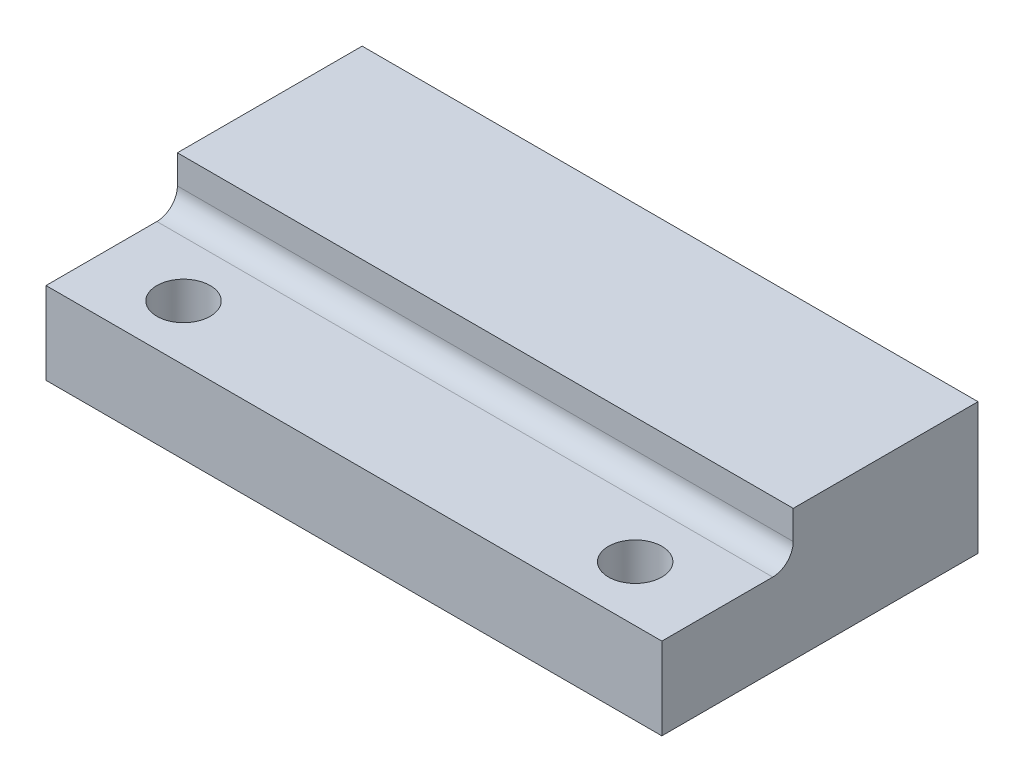
ISO-10303-21;
HEADER;
FILE_DESCRIPTION(('STEP AP214'),'2;1');
FILE_NAME('part.step','',(''),(''),'','','');
FILE_SCHEMA(('AUTOMOTIVE_DESIGN { 1 0 10303 214 1 1 1 1 }'));
ENDSEC;
DATA;
#1=APPLICATION_CONTEXT('core data for automotive mechanical design processes');
#2=APPLICATION_PROTOCOL_DEFINITION('international standard','automotive_design',2000,#1);
#3=PRODUCT_CONTEXT('',#1,'mechanical');
#4=PRODUCT('Part','Part','',(#3));
#5=PRODUCT_RELATED_PRODUCT_CATEGORY('part','',(#4));
#6=PRODUCT_DEFINITION_FORMATION('','',#4);
#7=PRODUCT_DEFINITION_CONTEXT('part definition',#1,'design');
#8=PRODUCT_DEFINITION('design','',#6,#7);
#9=PRODUCT_DEFINITION_SHAPE('','',#8);
#10=(LENGTH_UNIT() NAMED_UNIT(*) SI_UNIT(.MILLI.,.METRE.));
#11=(NAMED_UNIT(*) PLANE_ANGLE_UNIT() SI_UNIT($,.RADIAN.));
#12=(NAMED_UNIT(*) SI_UNIT($,.STERADIAN.) SOLID_ANGLE_UNIT());
#13=UNCERTAINTY_MEASURE_WITH_UNIT(LENGTH_MEASURE(1.E-05),#10,'distance_accuracy_value','');
#14=(GEOMETRIC_REPRESENTATION_CONTEXT(3) GLOBAL_UNCERTAINTY_ASSIGNED_CONTEXT((#13)) GLOBAL_UNIT_ASSIGNED_CONTEXT((#10,
#11,#12)) REPRESENTATION_CONTEXT('',''));
#15=CARTESIAN_POINT('',(0.,0.,0.));
#16=DIRECTION('',(0.,0.,1.));
#17=DIRECTION('',(1.,0.,0.));
#18=AXIS2_PLACEMENT_3D('',#15,#16,#17);
#19=CARTESIAN_POINT('',(0.,6.40000000000004,0.));
#20=DIRECTION('',(0.,1.00000000000001,0.));
#21=DIRECTION('',(0.,0.,1.));
#22=AXIS2_PLACEMENT_3D('',#19,#20,#21);
#23=PLANE('',#22);
#24=DIRECTION('',(0.,0.,1.));
#25=VECTOR('',#24,1.);
#26=CARTESIAN_POINT('',(-30.0000000000002,6.39999999999998,-15.4));
#27=LINE('',#26,#25);
#28=CARTESIAN_POINT('',(-30.0000000000002,6.39999999999998,-15.4));
#29=VERTEX_POINT('',#28);
#30=CARTESIAN_POINT('',(-30.0000000000002,6.40000000000007,-6.40000000000001));
#31=VERTEX_POINT('',#30);
#32=EDGE_CURVE('E229',#29,#31,#27,.T.);
#33=ORIENTED_EDGE('',*,*,#32,.T.);
#34=DIRECTION('',(1.,0.,0.));
#35=VECTOR('',#34,1.);
#36=CARTESIAN_POINT('',(-30.0000000000002,6.40000000000007,-6.40000000000001));
#37=LINE('',#36,#35);
#38=CARTESIAN_POINT('',(-1.66533453693773E-13,6.40000000000002,-6.40000000000001));
#39=VERTEX_POINT('',#38);
#40=EDGE_CURVE('E227',#31,#39,#37,.T.);
#41=ORIENTED_EDGE('',*,*,#40,.T.);
#42=DIRECTION('',(0.,0.,-1.));
#43=VECTOR('',#42,1.);
#44=CARTESIAN_POINT('',(-1.66533453693773E-13,6.4,-15.4));
#45=LINE('',#44,#43);
#46=CARTESIAN_POINT('',(-1.66533453693773E-13,6.4,-15.4));
#47=VERTEX_POINT('',#46);
#48=EDGE_CURVE('E216',#39,#47,#45,.T.);
#49=ORIENTED_EDGE('',*,*,#48,.T.);
#50=DIRECTION('',(-1.,0.,0.));
#51=VECTOR('',#50,1.);
#52=CARTESIAN_POINT('',(-30.0000000000002,6.39999999999998,-15.4));
#53=LINE('',#52,#51);
#54=EDGE_CURVE('E222',#47,#29,#53,.T.);
#55=ORIENTED_EDGE('',*,*,#54,.T.);
#56=EDGE_LOOP('',(#33,#41,#49,#55));
#57=FACE_BOUND('',#56,.T.);
#58=ADVANCED_FACE('F57',(#57),#23,.T.);
#59=CARTESIAN_POINT('',(0.,0.,0.));
#60=DIRECTION('',(0.,1.00000000000001,0.));
#61=DIRECTION('',(0.,0.,1.));
#62=AXIS2_PLACEMENT_3D('',#59,#60,#61);
#63=PLANE('',#62);
#64=DIRECTION('',(0.,0.,-1.));
#65=VECTOR('',#64,1.);
#66=CARTESIAN_POINT('',(-1.66533453693773E-13,0.,-15.4));
#67=LINE('',#66,#65);
#68=CARTESIAN_POINT('',(0.,0.,0.));
#69=VERTEX_POINT('',#68);
#70=CARTESIAN_POINT('',(-1.66533453693773E-13,0.,-15.4));
#71=VERTEX_POINT('',#70);
#72=EDGE_CURVE('E271',#69,#71,#67,.T.);
#73=ORIENTED_EDGE('',*,*,#72,.F.);
#74=DIRECTION('',(1.,0.,0.));
#75=VECTOR('',#74,1.);
#76=CARTESIAN_POINT('',(-30.,1.04083408558608E-13,0.));
#77=LINE('',#76,#75);
#78=CARTESIAN_POINT('',(-30.,1.04083408558608E-13,0.));
#79=VERTEX_POINT('',#78);
#80=EDGE_CURVE('E223',#79,#69,#77,.T.);
#81=ORIENTED_EDGE('',*,*,#80,.F.);
#82=DIRECTION('',(0.,0.,1.));
#83=VECTOR('',#82,1.);
#84=CARTESIAN_POINT('',(-30.0000000000002,0.,-15.4));
#85=LINE('',#84,#83);
#86=CARTESIAN_POINT('',(-30.0000000000002,0.,-15.4));
#87=VERTEX_POINT('',#86);
#88=EDGE_CURVE('E283',#87,#79,#85,.T.);
#89=ORIENTED_EDGE('',*,*,#88,.F.);
#90=DIRECTION('',(-1.,0.,0.));
#91=VECTOR('',#90,1.);
#92=CARTESIAN_POINT('',(-30.0000000000002,0.,-15.4));
#93=LINE('',#92,#91);
#94=EDGE_CURVE('E280',#71,#87,#93,.T.);
#95=ORIENTED_EDGE('',*,*,#94,.F.);
#96=EDGE_LOOP('',(#73,#81,#89,#95));
#97=FACE_BOUND('',#96,.T.);
#98=CARTESIAN_POINT('',(-26.,0.,-2.7));
#99=DIRECTION('',(0.,1.00000000000001,0.));
#100=DIRECTION('',(0.,0.,1.));
#101=AXIS2_PLACEMENT_3D('',#98,#99,#100);
#102=CIRCLE('',#101,1.3);
#103=CARTESIAN_POINT('',(-26.,0.,-1.4));
#104=VERTEX_POINT('',#103);
#105=EDGE_CURVE('E268',#104,#104,#102,.T.);
#106=ORIENTED_EDGE('',*,*,#105,.T.);
#107=EDGE_LOOP('',(#106));
#108=FACE_BOUND('',#107,.T.);
#109=CARTESIAN_POINT('',(-4.,0.,-2.7));
#110=DIRECTION('',(0.,1.00000000000001,0.));
#111=DIRECTION('',(0.,0.,1.));
#112=AXIS2_PLACEMENT_3D('',#109,#110,#111);
#113=CIRCLE('',#112,1.3);
#114=CARTESIAN_POINT('',(-4.,0.,-1.4));
#115=VERTEX_POINT('',#114);
#116=EDGE_CURVE('E264',#115,#115,#113,.T.);
#117=ORIENTED_EDGE('',*,*,#116,.T.);
#118=EDGE_LOOP('',(#117));
#119=FACE_BOUND('',#118,.T.);
#120=ADVANCED_FACE('F195',(#97,#108,#119),#63,.F.);
#121=CARTESIAN_POINT('',(-1.66533453693773E-13,6.4,-15.4));
#122=DIRECTION('',(-1.,0.,0.));
#123=DIRECTION('',(0.,0.,1.));
#124=AXIS2_PLACEMENT_3D('',#121,#122,#123);
#125=PLANE('',#124);
#126=ORIENTED_EDGE('',*,*,#48,.F.);
#127=DIRECTION('',(0.,1.00000000000001,0.));
#128=VECTOR('',#127,1.);
#129=CARTESIAN_POINT('',(-1.66533453693773E-13,-26.4138126514913,-6.4));
#130=LINE('',#129,#128);
#131=CARTESIAN_POINT('',(-1.66533453693773E-13,5.00000000000002,-6.40000000000001));
#132=VERTEX_POINT('',#131);
#133=EDGE_CURVE('E218',#132,#39,#130,.T.);
#134=ORIENTED_EDGE('',*,*,#133,.F.);
#135=CARTESIAN_POINT('',(0.,5.00000000000002,-5.4));
#136=DIRECTION('',(-1.,0.,0.));
#137=DIRECTION('',(0.,0.,1.));
#138=AXIS2_PLACEMENT_3D('',#135,#136,#137);
#139=CIRCLE('',#138,1.);
#140=CARTESIAN_POINT('',(0.,4.00000000000002,-5.4));
#141=VERTEX_POINT('',#140);
#142=EDGE_CURVE('E66',#132,#141,#139,.T.);
#143=ORIENTED_EDGE('',*,*,#142,.T.);
#144=DIRECTION('',(0.,0.,-1.));
#145=VECTOR('',#144,1.);
#146=CARTESIAN_POINT('',(0.,4.00000000000005,0.));
#147=LINE('',#146,#145);
#148=CARTESIAN_POINT('',(0.,4.00000000000005,0.));
#149=VERTEX_POINT('',#148);
#150=EDGE_CURVE('E148',#149,#141,#147,.T.);
#151=ORIENTED_EDGE('',*,*,#150,.F.);
#152=DIRECTION('',(0.,-1.00000000000001,0.));
#153=VECTOR('',#152,1.);
#154=CARTESIAN_POINT('',(0.,6.40000000000004,0.));
#155=LINE('',#154,#153);
#156=EDGE_CURVE('E277',#149,#69,#155,.T.);
#157=ORIENTED_EDGE('',*,*,#156,.T.);
#158=ORIENTED_EDGE('',*,*,#72,.T.);
#159=DIRECTION('',(0.,-1.00000000000001,0.));
#160=VECTOR('',#159,1.);
#161=CARTESIAN_POINT('',(-1.66533453693773E-13,6.4,-15.4));
#162=LINE('',#161,#160);
#163=EDGE_CURVE('E153',#47,#71,#162,.T.);
#164=ORIENTED_EDGE('',*,*,#163,.F.);
#165=EDGE_LOOP('',(#126,#134,#143,#151,#157,#158,#164));
#166=FACE_BOUND('',#165,.T.);
#167=ADVANCED_FACE('F199',(#166),#125,.F.);
#168=CARTESIAN_POINT('',(-30.0000000000002,6.39999999999998,-15.4));
#169=DIRECTION('',(0.,0.,1.));
#170=DIRECTION('',(1.,0.,0.));
#171=AXIS2_PLACEMENT_3D('',#168,#169,#170);
#172=PLANE('',#171);
#173=CARTESIAN_POINT('',(-4.00000000000017,3.69999999999997,-15.4));
#174=DIRECTION('',(0.,0.,-1.));
#175=DIRECTION('',(-1.,0.,0.));
#176=AXIS2_PLACEMENT_3D('',#173,#174,#175);
#177=CIRCLE('',#176,1.);
#178=CARTESIAN_POINT('',(-5.00000000000017,3.69999999999997,-15.4));
#179=VERTEX_POINT('',#178);
#180=EDGE_CURVE('E241',#179,#179,#177,.T.);
#181=ORIENTED_EDGE('',*,*,#180,.F.);
#182=EDGE_LOOP('',(#181));
#183=FACE_BOUND('',#182,.T.);
#184=CARTESIAN_POINT('',(-26.0000000000002,3.69999999999998,-15.4));
#185=DIRECTION('',(0.,0.,-1.));
#186=DIRECTION('',(-1.,0.,0.));
#187=AXIS2_PLACEMENT_3D('',#184,#185,#186);
#188=CIRCLE('',#187,1.);
#189=CARTESIAN_POINT('',(-27.0000000000002,3.69999999999998,-15.4));
#190=VERTEX_POINT('',#189);
#191=EDGE_CURVE('E244',#190,#190,#188,.T.);
#192=ORIENTED_EDGE('',*,*,#191,.F.);
#193=EDGE_LOOP('',(#192));
#194=FACE_BOUND('',#193,.T.);
#195=ORIENTED_EDGE('',*,*,#94,.T.);
#196=DIRECTION('',(0.,-1.00000000000001,0.));
#197=VECTOR('',#196,1.);
#198=CARTESIAN_POINT('',(-30.0000000000002,6.39999999999998,-15.4));
#199=LINE('',#198,#197);
#200=EDGE_CURVE('E161',#29,#87,#199,.T.);
#201=ORIENTED_EDGE('',*,*,#200,.F.);
#202=ORIENTED_EDGE('',*,*,#54,.F.);
#203=ORIENTED_EDGE('',*,*,#163,.T.);
#204=EDGE_LOOP('',(#195,#201,#202,#203));
#205=FACE_BOUND('',#204,.T.);
#206=ADVANCED_FACE('F207',(#183,#194,#205),#172,.F.);
#207=CARTESIAN_POINT('',(-30.0000000000002,6.39999999999998,-15.4));
#208=DIRECTION('',(1.,0.,0.));
#209=DIRECTION('',(0.,0.,-1.));
#210=AXIS2_PLACEMENT_3D('',#207,#208,#209);
#211=PLANE('',#210);
#212=DIRECTION('',(0.,0.,-1.));
#213=VECTOR('',#212,1.);
#214=CARTESIAN_POINT('',(-30.,4.00000000000009,0.));
#215=LINE('',#214,#213);
#216=CARTESIAN_POINT('',(-30.,4.00000000000009,0.));
#217=VERTEX_POINT('',#216);
#218=CARTESIAN_POINT('',(-30.,4.00000000000003,-5.4));
#219=VERTEX_POINT('',#218);
#220=EDGE_CURVE('E252',#217,#219,#215,.T.);
#221=ORIENTED_EDGE('',*,*,#220,.T.);
#222=CARTESIAN_POINT('',(-30.,5.00000000000003,-5.40000000000003));
#223=DIRECTION('',(1.,0.,0.));
#224=DIRECTION('',(0.,0.,-1.));
#225=AXIS2_PLACEMENT_3D('',#222,#223,#224);
#226=CIRCLE('',#225,1.);
#227=CARTESIAN_POINT('',(-30.0000000000002,5.00000000000005,-6.40000000000003));
#228=VERTEX_POINT('',#227);
#229=EDGE_CURVE('E11',#219,#228,#226,.T.);
#230=ORIENTED_EDGE('',*,*,#229,.T.);
#231=DIRECTION('',(0.,1.00000000000001,0.));
#232=VECTOR('',#231,1.);
#233=CARTESIAN_POINT('',(-30.0000000000001,-26.4138126514912,-6.40000000000002));
#234=LINE('',#233,#232);
#235=EDGE_CURVE('E238',#228,#31,#234,.T.);
#236=ORIENTED_EDGE('',*,*,#235,.T.);
#237=ORIENTED_EDGE('',*,*,#32,.F.);
#238=ORIENTED_EDGE('',*,*,#200,.T.);
#239=ORIENTED_EDGE('',*,*,#88,.T.);
#240=DIRECTION('',(0.,-1.00000000000001,0.));
#241=VECTOR('',#240,1.);
#242=CARTESIAN_POINT('',(-30.,6.40000000000011,0.));
#243=LINE('',#242,#241);
#244=EDGE_CURVE('E292',#217,#79,#243,.T.);
#245=ORIENTED_EDGE('',*,*,#244,.F.);
#246=EDGE_LOOP('',(#221,#230,#236,#237,#238,#239,#245));
#247=FACE_BOUND('',#246,.T.);
#248=ADVANCED_FACE('F203',(#247),#211,.F.);
#249=CARTESIAN_POINT('',(-30.,6.40000000000011,0.));
#250=DIRECTION('',(0.,0.,-1.));
#251=DIRECTION('',(-1.,0.,0.));
#252=AXIS2_PLACEMENT_3D('',#249,#250,#251);
#253=PLANE('',#252);
#254=ORIENTED_EDGE('',*,*,#156,.F.);
#255=DIRECTION('',(1.,0.,0.));
#256=VECTOR('',#255,1.);
#257=CARTESIAN_POINT('',(-30.,4.00000000000009,0.));
#258=LINE('',#257,#256);
#259=EDGE_CURVE('E255',#217,#149,#258,.T.);
#260=ORIENTED_EDGE('',*,*,#259,.F.);
#261=ORIENTED_EDGE('',*,*,#244,.T.);
#262=ORIENTED_EDGE('',*,*,#80,.T.);
#263=EDGE_LOOP('',(#254,#260,#261,#262));
#264=FACE_BOUND('',#263,.T.);
#265=ADVANCED_FACE('F191',(#264),#253,.F.);
#266=CARTESIAN_POINT('',(-26.,6.40000000000012,-2.69999999999999));
#267=DIRECTION('',(0.,-1.00000000000001,0.));
#268=DIRECTION('',(0.,0.,-1.));
#269=AXIS2_PLACEMENT_3D('',#266,#267,#268);
#270=CYLINDRICAL_SURFACE('',#269,1.3);
#271=CARTESIAN_POINT('',(-26.,4.00000000000012,-2.69999999999999));
#272=DIRECTION('',(0.,-1.00000000000001,0.));
#273=DIRECTION('',(0.,0.,-1.));
#274=AXIS2_PLACEMENT_3D('',#271,#272,#273);
#275=CIRCLE('',#274,1.3);
#276=CARTESIAN_POINT('',(-26.,4.00000000000012,-4.));
#277=VERTEX_POINT('',#276);
#278=EDGE_CURVE('E260',#277,#277,#275,.T.);
#279=ORIENTED_EDGE('',*,*,#278,.F.);
#280=EDGE_LOOP('',(#279));
#281=FACE_BOUND('',#280,.T.);
#282=ORIENTED_EDGE('',*,*,#105,.F.);
#283=EDGE_LOOP('',(#282));
#284=FACE_BOUND('',#283,.T.);
#285=ADVANCED_FACE('F187',(#281,#284),#270,.F.);
#286=CARTESIAN_POINT('',(-4.,6.40000000000002,-2.69999999999999));
#287=DIRECTION('',(0.,-1.00000000000001,0.));
#288=DIRECTION('',(0.,0.,-1.));
#289=AXIS2_PLACEMENT_3D('',#286,#287,#288);
#290=CYLINDRICAL_SURFACE('',#289,1.3);
#291=CARTESIAN_POINT('',(-4.,4.00000000000002,-2.69999999999998));
#292=DIRECTION('',(0.,-1.00000000000001,0.));
#293=DIRECTION('',(0.,0.,-1.));
#294=AXIS2_PLACEMENT_3D('',#291,#292,#293);
#295=CIRCLE('',#294,1.3);
#296=CARTESIAN_POINT('',(-4.,4.00000000000002,-3.99999999999999));
#297=VERTEX_POINT('',#296);
#298=EDGE_CURVE('E170',#297,#297,#295,.T.);
#299=ORIENTED_EDGE('',*,*,#298,.F.);
#300=EDGE_LOOP('',(#299));
#301=FACE_BOUND('',#300,.T.);
#302=ORIENTED_EDGE('',*,*,#116,.F.);
#303=EDGE_LOOP('',(#302));
#304=FACE_BOUND('',#303,.T.);
#305=ADVANCED_FACE('F182',(#301,#304),#290,.F.);
#306=CARTESIAN_POINT('',(-30.,4.00000000000009,0.));
#307=DIRECTION('',(0.,-1.00000000000001,0.));
#308=DIRECTION('',(0.,0.,-1.));
#309=AXIS2_PLACEMENT_3D('',#306,#307,#308);
#310=PLANE('',#309);
#311=ORIENTED_EDGE('',*,*,#278,.T.);
#312=EDGE_LOOP('',(#311));
#313=FACE_BOUND('',#312,.T.);
#314=ORIENTED_EDGE('',*,*,#298,.T.);
#315=EDGE_LOOP('',(#314));
#316=FACE_BOUND('',#315,.T.);
#317=ORIENTED_EDGE('',*,*,#150,.T.);
#318=DIRECTION('',(1.,0.,0.));
#319=VECTOR('',#318,1.);
#320=CARTESIAN_POINT('',(-30.,4.00000000000003,-5.4));
#321=LINE('',#320,#319);
#322=EDGE_CURVE('E73',#141,#219,#321,.F.);
#323=ORIENTED_EDGE('',*,*,#322,.T.);
#324=ORIENTED_EDGE('',*,*,#220,.F.);
#325=ORIENTED_EDGE('',*,*,#259,.T.);
#326=EDGE_LOOP('',(#317,#323,#324,#325));
#327=FACE_BOUND('',#326,.T.);
#328=ADVANCED_FACE('F177',(#313,#316,#327),#310,.F.);
#329=CARTESIAN_POINT('',(-30.0000000000001,-26.4138126514912,-6.40000000000002));
#330=DIRECTION('',(0.,0.,1.));
#331=DIRECTION('',(1.,0.,0.));
#332=AXIS2_PLACEMENT_3D('',#329,#330,#331);
#333=PLANE('',#332);
#334=ORIENTED_EDGE('',*,*,#235,.F.);
#335=DIRECTION('',(1.,0.,0.));
#336=VECTOR('',#335,1.);
#337=CARTESIAN_POINT('',(-30.0000000000002,5.00000000000005,-6.40000000000003));
#338=LINE('',#337,#336);
#339=EDGE_CURVE('E311',#228,#132,#338,.T.);
#340=ORIENTED_EDGE('',*,*,#339,.T.);
#341=ORIENTED_EDGE('',*,*,#133,.T.);
#342=ORIENTED_EDGE('',*,*,#40,.F.);
#343=EDGE_LOOP('',(#334,#340,#341,#342));
#344=FACE_BOUND('',#343,.T.);
#345=ADVANCED_FACE('F181',(#344),#333,.T.);
#346=CARTESIAN_POINT('',(-26.0000000000002,3.70000000000005,-8.40000000000003));
#347=DIRECTION('',(0.,0.,-1.));
#348=DIRECTION('',(-1.,0.,0.));
#349=AXIS2_PLACEMENT_3D('',#346,#347,#348);
#350=PLANE('',#349);
#351=CARTESIAN_POINT('',(-26.0000000000002,3.70000000000005,-8.40000000000003));
#352=DIRECTION('',(0.,0.,-1.));
#353=DIRECTION('',(-1.,0.,0.));
#354=AXIS2_PLACEMENT_3D('',#351,#352,#353);
#355=CIRCLE('',#354,1.);
#356=CARTESIAN_POINT('',(-27.0000000000002,3.70000000000005,-8.40000000000003));
#357=VERTEX_POINT('',#356);
#358=EDGE_CURVE('E508',#357,#357,#355,.T.);
#359=ORIENTED_EDGE('',*,*,#358,.T.);
#360=EDGE_LOOP('',(#359));
#361=FACE_BOUND('',#360,.T.);
#362=CARTESIAN_POINT('',(-26.0000000000002,3.70000000000005,-8.40000000000003));
#363=DIRECTION('',(0.,0.,-1.));
#364=DIRECTION('',(-1.,0.,0.));
#365=AXIS2_PLACEMENT_3D('',#362,#363,#364);
#366=CIRCLE('',#365,0.799999999999999);
#367=CARTESIAN_POINT('',(-25.2583801512906,4.00000000000006,-8.40000000000002));
#368=VERTEX_POINT('',#367);
#369=CARTESIAN_POINT('',(-26.7416198487098,4.00000000000006,-8.4));
#370=VERTEX_POINT('',#369);
#371=EDGE_CURVE('E136',#368,#370,#366,.T.);
#372=ORIENTED_EDGE('',*,*,#371,.F.);
#373=DIRECTION('',(1.,0.,0.));
#374=VECTOR('',#373,1.);
#375=CARTESIAN_POINT('',(-30.0000000000002,4.00000000000002,-8.40000000000001));
#376=LINE('',#375,#374);
#377=EDGE_CURVE('E133',#370,#368,#376,.T.);
#378=ORIENTED_EDGE('',*,*,#377,.F.);
#379=EDGE_LOOP('',(#372,#378));
#380=FACE_BOUND('',#379,.T.);
#381=ADVANCED_FACE('F135',(#361,#380),#350,.T.);
#382=CARTESIAN_POINT('',(-26.0000000000002,3.70000000000005,-8.40000000000003));
#383=DIRECTION('',(0.,0.,-1.));
#384=DIRECTION('',(-1.,0.,0.));
#385=AXIS2_PLACEMENT_3D('',#382,#383,#384);
#386=CYLINDRICAL_SURFACE('',#385,1.);
#387=ORIENTED_EDGE('',*,*,#358,.F.);
#388=EDGE_LOOP('',(#387));
#389=FACE_BOUND('',#388,.T.);
#390=ORIENTED_EDGE('',*,*,#191,.T.);
#391=EDGE_LOOP('',(#390));
#392=FACE_BOUND('',#391,.T.);
#393=ADVANCED_FACE('F334',(#389,#392),#386,.F.);
#394=CARTESIAN_POINT('',(-4.00000000000017,3.70000000000001,-8.4));
#395=DIRECTION('',(0.,0.,-1.));
#396=DIRECTION('',(-1.,0.,0.));
#397=AXIS2_PLACEMENT_3D('',#394,#395,#396);
#398=PLANE('',#397);
#399=CARTESIAN_POINT('',(-4.00000000000017,3.70000000000001,-8.4));
#400=DIRECTION('',(0.,0.,-1.));
#401=DIRECTION('',(-1.,0.,0.));
#402=AXIS2_PLACEMENT_3D('',#399,#400,#401);
#403=CIRCLE('',#402,1.);
#404=CARTESIAN_POINT('',(-5.00000000000017,3.70000000000001,-8.4));
#405=VERTEX_POINT('',#404);
#406=EDGE_CURVE('E233',#405,#405,#403,.T.);
#407=ORIENTED_EDGE('',*,*,#406,.T.);
#408=EDGE_LOOP('',(#407));
#409=FACE_BOUND('',#408,.T.);
#410=CARTESIAN_POINT('',(-4.00000000000017,3.70000000000001,-8.4));
#411=DIRECTION('',(0.,0.,-1.));
#412=DIRECTION('',(-1.,0.,0.));
#413=AXIS2_PLACEMENT_3D('',#410,#411,#412);
#414=CIRCLE('',#413,0.799999999999999);
#415=CARTESIAN_POINT('',(-3.2583801512906,4.,-8.40000000000001));
#416=VERTEX_POINT('',#415);
#417=CARTESIAN_POINT('',(-4.74161984870974,3.99999999999997,-8.4));
#418=VERTEX_POINT('',#417);
#419=EDGE_CURVE('E149',#416,#418,#414,.T.);
#420=ORIENTED_EDGE('',*,*,#419,.F.);
#421=DIRECTION('',(1.,0.,0.));
#422=VECTOR('',#421,1.);
#423=CARTESIAN_POINT('',(-30.0000000000002,4.00000000000002,-8.40000000000001));
#424=LINE('',#423,#422);
#425=EDGE_CURVE('E141',#418,#416,#424,.T.);
#426=ORIENTED_EDGE('',*,*,#425,.F.);
#427=EDGE_LOOP('',(#420,#426));
#428=FACE_BOUND('',#427,.T.);
#429=ADVANCED_FACE('F331',(#409,#428),#398,.T.);
#430=CARTESIAN_POINT('',(-4.00000000000017,3.70000000000001,-8.4));
#431=DIRECTION('',(0.,0.,-1.));
#432=DIRECTION('',(-1.,0.,0.));
#433=AXIS2_PLACEMENT_3D('',#430,#431,#432);
#434=CYLINDRICAL_SURFACE('',#433,1.);
#435=ORIENTED_EDGE('',*,*,#406,.F.);
#436=EDGE_LOOP('',(#435));
#437=FACE_BOUND('',#436,.T.);
#438=ORIENTED_EDGE('',*,*,#180,.T.);
#439=EDGE_LOOP('',(#438));
#440=FACE_BOUND('',#439,.T.);
#441=ADVANCED_FACE('F333',(#437,#440),#434,.F.);
#442=CARTESIAN_POINT('',(-30.,4.00000000000009,0.));
#443=DIRECTION('',(0.,-1.00000000000001,0.));
#444=DIRECTION('',(0.,0.,-1.));
#445=AXIS2_PLACEMENT_3D('',#442,#443,#444);
#446=PLANE('',#445);
#447=CARTESIAN_POINT('',(-30.1023639023298,4.00000000000005,-10.3908426418077));
#448=CARTESIAN_POINT('',(-29.9581284869886,4.00000000000008,-10.3044101022298));
#449=CARTESIAN_POINT('',(-29.8138840497899,4.00000000000009,-10.2179925984284));
#450=CARTESIAN_POINT('',(-29.5253613876936,4.0000000000001,-10.0452059436675));
#451=CARTESIAN_POINT('',(-29.3810831620507,4.0000000000001,-9.9588367939526));
#452=CARTESIAN_POINT('',(-29.0923923239413,4.00000000000009,-9.78611436970076));
#453=CARTESIAN_POINT('',(-28.9479796844303,4.00000000000009,-9.69976114036376));
#454=CARTESIAN_POINT('',(-28.6590930589183,4.00000000000009,-9.52716517986323));
#455=CARTESIAN_POINT('',(-28.5146190744732,4.00000000000009,-9.44092244609686));
#456=CARTESIAN_POINT('',(-28.2281711988826,4.00000000000009,-9.27017000349626));
#457=CARTESIAN_POINT('',(-28.0861992155882,4.0000000000001,-9.18565709364191));
#458=CARTESIAN_POINT('',(-27.8020674297468,4.0000000000001,-9.01692429035654));
#459=CARTESIAN_POINT('',(-27.6599076147789,4.00000000000009,-8.93270441779505));
#460=CARTESIAN_POINT('',(-27.4464176160662,4.0000000000001,-8.80686636038516));
#461=CARTESIAN_POINT('',(-27.375227328632,4.0000000000001,-8.76501091065728));
#462=CARTESIAN_POINT('',(-27.2326981563793,4.00000000000009,-8.68154872094124));
#463=CARTESIAN_POINT('',(-27.161359267621,4.00000000000009,-8.63994198766349));
#464=CARTESIAN_POINT('',(-27.0184484157441,4.0000000000001,-8.55715254071233));
#465=CARTESIAN_POINT('',(-26.9468764840038,4.00000000000011,-8.51596977282823));
#466=CARTESIAN_POINT('',(-26.8033089752406,4.00000000000008,-8.434350794385));
#467=CARTESIAN_POINT('',(-26.7313134236011,4.00000000000004,-8.39391453968359));
#468=CARTESIAN_POINT('',(-26.6292194156643,4.00000000000007,-8.33809601116418));
#469=CARTESIAN_POINT('',(-26.5994981014279,4.00000000000009,-8.32202605320684));
#470=CARTESIAN_POINT('',(-26.53982840716,4.0000000000001,-8.29030035129024));
#471=CARTESIAN_POINT('',(-26.5098799937322,4.00000000000009,-8.27464466983456));
#472=CARTESIAN_POINT('',(-26.449442131894,4.0000000000001,-8.24385390279043));
#473=CARTESIAN_POINT('',(-26.4189503379084,4.00000000000011,-8.22872339521552));
#474=CARTESIAN_POINT('',(-26.3574786379925,4.00000000000008,-8.19949115519158));
#475=CARTESIAN_POINT('',(-26.3264988606219,4.00000000000005,-8.18538915711608));
#476=CARTESIAN_POINT('',(-26.2771196201152,4.00000000000006,-8.16458718879157));
#477=CARTESIAN_POINT('',(-26.2589762821202,4.00000000000009,-8.1572908768306));
#478=CARTESIAN_POINT('',(-26.2223798750178,4.0000000000001,-8.14352783326019));
#479=CARTESIAN_POINT('',(-26.2039267062149,4.0000000000001,-8.13706137469359));
#480=CARTESIAN_POINT('',(-26.1483847285544,4.00000000000008,-8.11953267530807));
#481=CARTESIAN_POINT('',(-26.1106808046528,4.00000000000004,-8.11014253894514));
#482=CARTESIAN_POINT('',(-26.0566307564314,4.00000000000007,-8.10252111406085));
#483=CARTESIAN_POINT('',(-26.0407551226918,4.00000000000009,-8.10097504270385));
#484=CARTESIAN_POINT('',(-26.0089317467177,4.0000000000001,-8.09939838896626));
#485=CARTESIAN_POINT('',(-25.992984037646,4.0000000000001,-8.09936716899361));
#486=CARTESIAN_POINT('',(-25.9610564937528,4.0000000000001,-8.1008283085399));
#487=CARTESIAN_POINT('',(-25.9450771316516,4.0000000000001,-8.10233063976504));
#488=CARTESIAN_POINT('',(-25.9133126043521,4.00000000000009,-8.10671378774597));
#489=CARTESIAN_POINT('',(-25.8975274697598,4.00000000000006,-8.1095948189728));
#490=CARTESIAN_POINT('',(-25.8580659980202,4.00000000000005,-8.11828027703609));
#491=CARTESIAN_POINT('',(-25.8345554641479,4.00000000000008,-8.12482583077872));
#492=CARTESIAN_POINT('',(-25.788091193042,4.00000000000011,-8.13968638071344));
#493=CARTESIAN_POINT('',(-25.7651382604299,4.0000000000001,-8.14800378222341));
#494=CARTESIAN_POINT('',(-25.7196016232457,4.00000000000009,-8.16582856211371));
#495=CARTESIAN_POINT('',(-25.6970197398486,4.00000000000009,-8.17534052052254));
#496=CARTESIAN_POINT('',(-25.6521978153916,4.0000000000001,-8.19514352118017));
#497=CARTESIAN_POINT('',(-25.6299578641776,4.00000000000009,-8.20543476412262));
#498=CARTESIAN_POINT('',(-25.5625330089502,4.0000000000001,-8.237601587036));
#499=CARTESIAN_POINT('',(-25.5177467080782,4.0000000000001,-8.26030675481404));
#500=CARTESIAN_POINT('',(-25.428872589874,4.00000000000009,-8.30672459619312));
#501=CARTESIAN_POINT('',(-25.3847831587727,4.00000000000006,-8.330434247547));
#502=CARTESIAN_POINT('',(-25.2958700931861,4.00000000000006,-8.37905857706974));
#503=CARTESIAN_POINT('',(-25.2510548222253,4.00000000000009,-8.40398854308645));
#504=CARTESIAN_POINT('',(-25.1616467345762,4.0000000000001,-8.4542431256268));
#505=CARTESIAN_POINT('',(-25.1170539200367,4.0000000000001,-8.47956774595294));
#506=CARTESIAN_POINT('',(-24.9834841296562,4.00000000000009,-8.55592284658601));
#507=CARTESIAN_POINT('',(-24.8947230409076,4.00000000000009,-8.60733053905953));
#508=CARTESIAN_POINT('',(-24.717356752108,4.0000000000001,-8.71069904533383));
#509=CARTESIAN_POINT('',(-24.6287519503363,4.0000000000001,-8.76266053884868));
#510=CARTESIAN_POINT('',(-24.4517099900377,4.00000000000009,-8.86686002592182));
#511=CARTESIAN_POINT('',(-24.3632728247059,4.0000000000001,-8.91909800791506));
#512=CARTESIAN_POINT('',(-24.1966307308567,4.0000000000001,-9.01774713169851));
#513=CARTESIAN_POINT('',(-24.1184148753923,4.0000000000001,-9.06413984002538));
#514=CARTESIAN_POINT('',(-23.9620374214247,4.0000000000001,-9.15701896600126));
#515=CARTESIAN_POINT('',(-23.883875823653,4.0000000000001,-9.20350538488213));
#516=CARTESIAN_POINT('',(-23.7277091315702,4.0000000000001,-9.2964748442496));
#517=CARTESIAN_POINT('',(-23.6497039781814,4.00000000000009,-9.34295778553477));
#518=CARTESIAN_POINT('',(-23.4937246735651,4.0000000000001,-9.43597316443663));
#519=CARTESIAN_POINT('',(-23.4157505219168,4.0000000000001,-9.48250560134737));
#520=CARTESIAN_POINT('',(-23.3377865945958,4.00000000000011,-9.52905514329395));
#521=B_SPLINE_CURVE_WITH_KNOTS('',3,(#447,#448,#449,#450,#451,#452,#453,#454,#455,#456,#457,
#458,#459,#460,#461,#462,#463,#464,#465,#466,#467,#468,#469,#470,#471,#472,#473,#474,#475,#476,
#477,#478,#479,#480,#481,#482,#483,#484,#485,#486,#487,#488,#489,#490,#491,#492,#493,#494,#495,
#496,#497,#498,#499,#500,#501,#502,#503,#504,#505,#506,#507,#508,#509,#510,#511,#512,#513,#514,
#515,#516,#517,#518,#519,#520),.UNSPECIFIED.,.F.,.F.,(4,2,2,2,2,2,2,2,2,2,2,2,2,2,2,2,2,2,2,2,2,
2,2,2,2,2,2,2,2,2,2,2,2,2,2,2,4),(0.,0.504450161950323,1.00891276136362,1.51369686981226,
2.01846886039338,2.51413631101748,3.0098383677325,3.25758687783202,3.50534204232768,
3.75306512378263,4.00077350983303,4.10213414858607,4.20350999382621,4.3056182078777,
4.40769995703049,4.46634479318326,4.52500887577309,4.64091298178748,4.68870093893585,
4.7364687822388,4.78454922034667,4.83263714029606,4.90573601321384,4.97893475894021,
5.05242325125008,5.12593073426681,5.27653204707246,5.42670859519315,5.58055252218217,
5.73439793238065,6.04211358938723,6.35026464680067,6.65840291504873,6.9312215414381,
7.20404377785007,7.47645743386417,7.74886725519351),.UNSPECIFIED.);
#522=EDGE_CURVE('E146',#368,#370,#521,.F.);
#523=ORIENTED_EDGE('',*,*,#522,.T.);
#524=ORIENTED_EDGE('',*,*,#377,.T.);
#525=EDGE_LOOP('',(#523,#524));
#526=FACE_BOUND('',#525,.T.);
#527=ADVANCED_FACE('F151',(#526),#446,.T.);
#528=CARTESIAN_POINT('',(-26.0000000000002,3.70000000000005,-8.40000000000003));
#529=DIRECTION('',(0.,0.,-1.));
#530=DIRECTION('',(-1.,0.,0.));
#531=AXIS2_PLACEMENT_3D('',#528,#529,#530);
#532=CONICAL_SURFACE('',#531,0.799999999999999,1.02974425867665);
#533=CARTESIAN_POINT('',(-26.0000000000002,3.70000000000005,-7.91931150477797));
#534=VERTEX_POINT('',#533);
#535=VERTEX_LOOP('',#534);
#536=FACE_BOUND('',#535,.T.);
#537=ORIENTED_EDGE('',*,*,#371,.T.);
#538=ORIENTED_EDGE('',*,*,#522,.F.);
#539=EDGE_LOOP('',(#537,#538));
#540=FACE_BOUND('',#539,.T.);
#541=ADVANCED_FACE('F145',(#536,#540),#532,.F.);
#542=CARTESIAN_POINT('',(-8.10236390232988,4.00000000000007,-10.3908426418077));
#543=CARTESIAN_POINT('',(-7.95812848698867,4.00000000000009,-10.3044101022298));
#544=CARTESIAN_POINT('',(-7.81388404978991,4.0000000000001,-10.2179925984284));
#545=CARTESIAN_POINT('',(-7.52536138769361,4.0000000000001,-10.0452059436675));
#546=CARTESIAN_POINT('',(-7.3810831620507,4.0000000000001,-9.9588367939526));
#547=CARTESIAN_POINT('',(-7.0923923239413,4.0000000000001,-9.78611436970076));
#548=CARTESIAN_POINT('',(-6.94797968443035,4.0000000000001,-9.69976114036375));
#549=CARTESIAN_POINT('',(-6.65909305891833,4.0000000000001,-9.52716517986323));
#550=CARTESIAN_POINT('',(-6.51461907447317,4.0000000000001,-9.44092244609685));
#551=CARTESIAN_POINT('',(-6.22817119888259,4.0000000000001,-9.27017000349625));
#552=CARTESIAN_POINT('',(-6.08619921558817,4.0000000000001,-9.1856570936419));
#553=CARTESIAN_POINT('',(-5.80206742974683,4.0000000000001,-9.01692429035653));
#554=CARTESIAN_POINT('',(-5.65990761477893,4.0000000000001,-8.93270441779504));
#555=CARTESIAN_POINT('',(-5.44641761606615,4.0000000000001,-8.80686636038515));
#556=CARTESIAN_POINT('',(-5.37522732863195,4.0000000000001,-8.76501091065727));
#557=CARTESIAN_POINT('',(-5.2326981563793,4.0000000000001,-8.68154872094123));
#558=CARTESIAN_POINT('',(-5.16135926762096,4.00000000000008,-8.63994198766348));
#559=CARTESIAN_POINT('',(-5.01844841574407,4.00000000000011,-8.55715254071232));
#560=CARTESIAN_POINT('',(-4.94687648400375,4.00000000000016,-8.51596977282822));
#561=CARTESIAN_POINT('',(-4.80330897524061,4.00000000000004,-8.434350794385));
#562=CARTESIAN_POINT('',(-4.7313134236011,3.99999999999989,-8.3939145396836));
#563=CARTESIAN_POINT('',(-4.62921941566424,4.,-8.33809601116419));
#564=CARTESIAN_POINT('',(-4.59949810142785,4.00000000000008,-8.32202605320683));
#565=CARTESIAN_POINT('',(-4.53982840715997,4.00000000000012,-8.29030035129023));
#566=CARTESIAN_POINT('',(-4.50987999373219,4.0000000000001,-8.27464466983455));
#567=CARTESIAN_POINT('',(-4.44944213189403,4.0000000000001,-8.24385390279043));
#568=CARTESIAN_POINT('',(-4.41895033790836,4.00000000000013,-8.22872339521552));
#569=CARTESIAN_POINT('',(-4.35747863799252,4.00000000000007,-8.19949115519157));
#570=CARTESIAN_POINT('',(-4.3264988606219,3.99999999999998,-8.18538915711606));
#571=CARTESIAN_POINT('',(-4.27711962011516,4.00000000000002,-8.16458718879156));
#572=CARTESIAN_POINT('',(-4.25897628212022,4.00000000000007,-8.1572908768306));
#573=CARTESIAN_POINT('',(-4.22237987501774,4.00000000000013,-8.14352783326019));
#574=CARTESIAN_POINT('',(-4.20392670621482,4.00000000000012,-8.13706137469359));
#575=CARTESIAN_POINT('',(-4.14838472855436,4.00000000000006,-8.11953267530806));
#576=CARTESIAN_POINT('',(-4.11068080465274,3.99999999999994,-8.11014253894512));
#577=CARTESIAN_POINT('',(-4.0566307564314,4.00000000000003,-8.10252111406085));
#578=CARTESIAN_POINT('',(-4.04075512269177,4.00000000000008,-8.10097504270386));
#579=CARTESIAN_POINT('',(-4.00893174671767,4.00000000000012,-8.09939838896627));
#580=CARTESIAN_POINT('',(-3.99298403764596,4.0000000000001,-8.09936716899362));
#581=CARTESIAN_POINT('',(-3.96105649375281,4.0000000000001,-8.10082830853991));
#582=CARTESIAN_POINT('',(-3.94507713165167,4.00000000000012,-8.10233063976504));
#583=CARTESIAN_POINT('',(-3.91331260435211,4.00000000000008,-8.10671378774597));
#584=CARTESIAN_POINT('',(-3.8975274697598,4.00000000000002,-8.10959481897279));
#585=CARTESIAN_POINT('',(-3.85806599802022,3.99999999999998,-8.11828027703607));
#586=CARTESIAN_POINT('',(-3.83455546414798,4.00000000000007,-8.1248258307787));
#587=CARTESIAN_POINT('',(-3.78809119304204,4.00000000000013,-8.13968638071343));
#588=CARTESIAN_POINT('',(-3.76513826042994,4.00000000000011,-8.14800378222339));
#589=CARTESIAN_POINT('',(-3.71960162324568,4.00000000000009,-8.16582856211369));
#590=CARTESIAN_POINT('',(-3.69701973984862,4.0000000000001,-8.17534052052252));
#591=CARTESIAN_POINT('',(-3.65219781539157,4.0000000000001,-8.19514352118015));
#592=CARTESIAN_POINT('',(-3.62995786417761,4.0000000000001,-8.2054347641226));
#593=CARTESIAN_POINT('',(-3.56253300895018,4.0000000000001,-8.23760158703598));
#594=CARTESIAN_POINT('',(-3.51774670807816,4.00000000000012,-8.26030675481403));
#595=CARTESIAN_POINT('',(-3.42887258987403,4.00000000000008,-8.3067245961931));
#596=CARTESIAN_POINT('',(-3.3847831587727,4.00000000000001,-8.33043424754699));
#597=CARTESIAN_POINT('',(-3.29587009318609,4.,-8.37905857706973));
#598=CARTESIAN_POINT('',(-3.25105482222526,4.00000000000007,-8.40398854308644));
#599=CARTESIAN_POINT('',(-3.16164673457615,4.00000000000013,-8.45424312562679));
#600=CARTESIAN_POINT('',(-3.11705392003672,4.00000000000011,-8.47956774595293));
#601=CARTESIAN_POINT('',(-2.98348412965617,4.00000000000008,-8.555922846586));
#602=CARTESIAN_POINT('',(-2.89472304090761,4.0000000000001,-8.60733053905952));
#603=CARTESIAN_POINT('',(-2.71735675210798,4.0000000000001,-8.71069904533382));
#604=CARTESIAN_POINT('',(-2.62875195033625,4.0000000000001,-8.76266053884867));
#605=CARTESIAN_POINT('',(-2.45170999003772,4.0000000000001,-8.86686002592181));
#606=CARTESIAN_POINT('',(-2.36327282470585,4.0000000000001,-8.91909800791504));
#607=CARTESIAN_POINT('',(-2.19663073085665,4.0000000000001,-9.01774713169849));
#608=CARTESIAN_POINT('',(-2.11841487539229,4.0000000000001,-9.06413984002537));
#609=CARTESIAN_POINT('',(-1.96203742142463,4.0000000000001,-9.15701896600125));
#610=CARTESIAN_POINT('',(-1.88387582365297,4.0000000000001,-9.20350538488212));
#611=CARTESIAN_POINT('',(-1.72770913157021,4.0000000000001,-9.29647484424959));
#612=CARTESIAN_POINT('',(-1.64970397818132,4.00000000000011,-9.34295778553476));
#613=CARTESIAN_POINT('',(-1.49372467356507,4.00000000000009,-9.43597316443662));
#614=CARTESIAN_POINT('',(-1.41575052191676,4.00000000000005,-9.48250560134737));
#615=CARTESIAN_POINT('',(-1.33778659459577,3.99999999999996,-9.52905514329396));
#616=B_SPLINE_CURVE_WITH_KNOTS('',3,(#542,#543,#544,#545,#546,#547,#548,#549,#550,#551,#552,
#553,#554,#555,#556,#557,#558,#559,#560,#561,#562,#563,#564,#565,#566,#567,#568,#569,#570,#571,
#572,#573,#574,#575,#576,#577,#578,#579,#580,#581,#582,#583,#584,#585,#586,#587,#588,#589,#590,
#591,#592,#593,#594,#595,#596,#597,#598,#599,#600,#601,#602,#603,#604,#605,#606,#607,#608,#609,
#610,#611,#612,#613,#614,#615),.UNSPECIFIED.,.F.,.F.,(4,2,2,2,2,2,2,2,2,2,2,2,2,2,2,2,2,2,2,2,2,
2,2,2,2,2,2,2,2,2,2,2,2,2,2,2,4),(0.,0.50445016195033,1.00891276136363,1.51369686981228,
2.01846886039341,2.51413631101751,3.00983836773253,3.25758687783206,3.50534204232771,
3.75306512378267,4.00077350983307,4.10213414858611,4.20350999382626,4.30561820787774,
4.40769995703053,4.46634479318331,4.52500887577315,4.64091298178753,4.68870093893588,
4.73646878223881,4.78454922034666,4.83263714029604,4.90573601321382,4.9789347589402,
5.05242325125007,5.12593073426682,5.27653204707248,5.42670859519319,5.58055252218221,
5.7343979323807,6.04211358938727,6.35026464680071,6.65840291504877,6.93122154143814,
7.20404377785011,7.47645743386422,7.74886725519356),.UNSPECIFIED.);
#617=EDGE_CURVE('E142',#416,#418,#616,.F.);
#618=ORIENTED_EDGE('',*,*,#617,.T.);
#619=ORIENTED_EDGE('',*,*,#425,.T.);
#620=EDGE_LOOP('',(#618,#619));
#621=FACE_BOUND('',#620,.T.);
#622=ADVANCED_FACE('F327',(#621),#446,.T.);
#623=CARTESIAN_POINT('',(-4.00000000000017,3.70000000000001,-8.4));
#624=DIRECTION('',(0.,0.,-1.));
#625=DIRECTION('',(-1.,0.,0.));
#626=AXIS2_PLACEMENT_3D('',#623,#624,#625);
#627=CONICAL_SURFACE('',#626,0.799999999999999,1.02974425867665);
#628=CARTESIAN_POINT('',(-4.00000000000017,3.69999999999998,-7.91931150477795));
#629=VERTEX_POINT('',#628);
#630=VERTEX_LOOP('',#629);
#631=FACE_BOUND('',#630,.T.);
#632=ORIENTED_EDGE('',*,*,#419,.T.);
#633=ORIENTED_EDGE('',*,*,#617,.F.);
#634=EDGE_LOOP('',(#632,#633));
#635=FACE_BOUND('',#634,.T.);
#636=ADVANCED_FACE('F330',(#631,#635),#627,.F.);
#637=CARTESIAN_POINT('',(-30.,5.00000000000003,-5.40000000000003));
#638=DIRECTION('',(1.,0.,0.));
#639=DIRECTION('',(0.,0.,-1.));
#640=AXIS2_PLACEMENT_3D('',#637,#638,#639);
#641=CYLINDRICAL_SURFACE('',#640,1.);
#642=ORIENTED_EDGE('',*,*,#229,.F.);
#643=ORIENTED_EDGE('',*,*,#322,.F.);
#644=ORIENTED_EDGE('',*,*,#142,.F.);
#645=ORIENTED_EDGE('',*,*,#339,.F.);
#646=EDGE_LOOP('',(#642,#643,#644,#645));
#647=FACE_BOUND('',#646,.T.);
#648=ADVANCED_FACE('F59',(#647),#641,.F.);
#649=CLOSED_SHELL('',(#58,#120,#167,#206,#248,#265,#285,#305,#328,#345,#381,#393,#429,#441,#527,
#541,#622,#636,#648));
#650=MANIFOLD_SOLID_BREP('B2',#649);
#651=ADVANCED_BREP_SHAPE_REPRESENTATION('',(#18,#650),#14);
#652=SHAPE_DEFINITION_REPRESENTATION(#9,#651);
ENDSEC;
END-ISO-10303-21;
